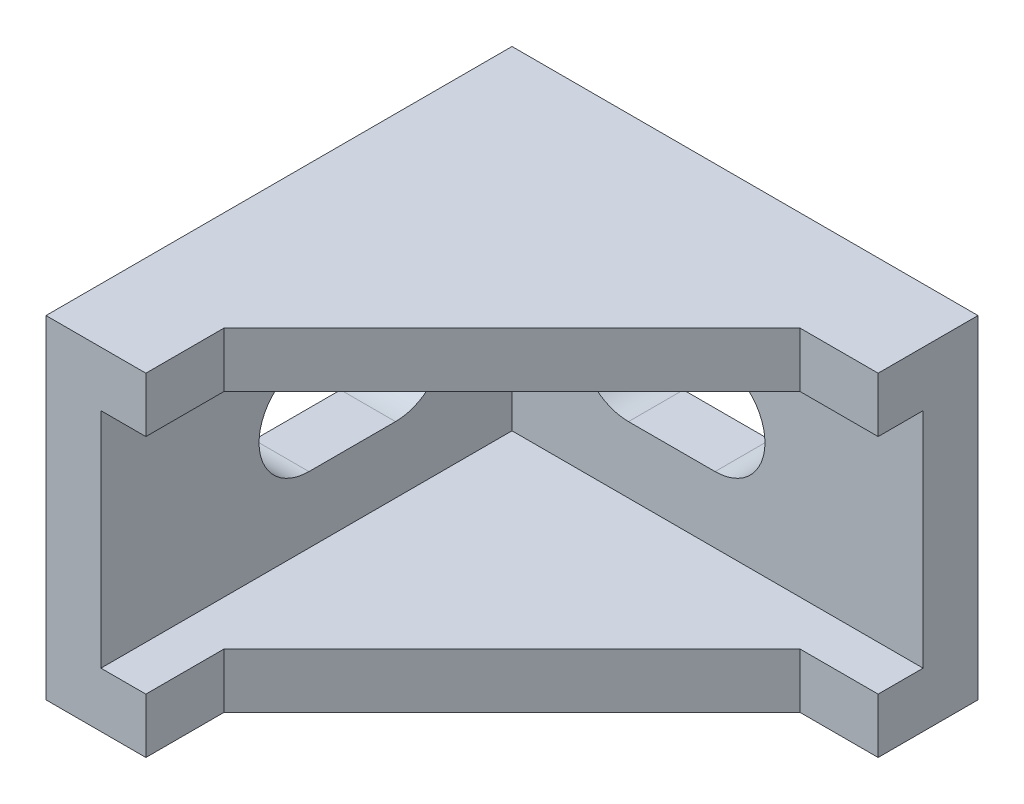
ISO-10303-21;
HEADER;
FILE_DESCRIPTION(('STEP AP214'),'2;1');
FILE_NAME('part.step','',(''),(''),'','','');
FILE_SCHEMA(('AUTOMOTIVE_DESIGN { 1 0 10303 214 1 1 1 1 }'));
ENDSEC;
DATA;
#1=APPLICATION_CONTEXT('core data for automotive mechanical design processes');
#2=APPLICATION_PROTOCOL_DEFINITION('international standard','automotive_design',2000,#1);
#3=PRODUCT_CONTEXT('',#1,'mechanical');
#4=PRODUCT('Part','Part','',(#3));
#5=PRODUCT_RELATED_PRODUCT_CATEGORY('part','',(#4));
#6=PRODUCT_DEFINITION_FORMATION('','',#4);
#7=PRODUCT_DEFINITION_CONTEXT('part definition',#1,'design');
#8=PRODUCT_DEFINITION('design','',#6,#7);
#9=PRODUCT_DEFINITION_SHAPE('','',#8);
#10=(LENGTH_UNIT() NAMED_UNIT(*) SI_UNIT(.MILLI.,.METRE.));
#11=(NAMED_UNIT(*) PLANE_ANGLE_UNIT() SI_UNIT($,.RADIAN.));
#12=(NAMED_UNIT(*) SI_UNIT($,.STERADIAN.) SOLID_ANGLE_UNIT());
#13=UNCERTAINTY_MEASURE_WITH_UNIT(LENGTH_MEASURE(1.E-05),#10,'distance_accuracy_value','');
#14=(GEOMETRIC_REPRESENTATION_CONTEXT(3) GLOBAL_UNCERTAINTY_ASSIGNED_CONTEXT((#13)) GLOBAL_UNIT_ASSIGNED_CONTEXT((#10,
#11,#12)) REPRESENTATION_CONTEXT('',''));
#15=CARTESIAN_POINT('',(0.,0.,0.));
#16=DIRECTION('',(0.,0.,1.));
#17=DIRECTION('',(1.,0.,0.));
#18=AXIS2_PLACEMENT_3D('',#15,#16,#17);
#19=CARTESIAN_POINT('',(28.,20.,-22.0000000000001));
#20=DIRECTION('',(0.,0.,-1.));
#21=DIRECTION('',(-1.,0.,0.));
#22=AXIS2_PLACEMENT_3D('',#19,#20,#21);
#23=PLANE('',#22);
#24=DIRECTION('',(0.,-1.,0.));
#25=VECTOR('',#24,1.);
#26=CARTESIAN_POINT('',(23.3,20.,-22.0000000000001));
#27=LINE('',#26,#25);
#28=CARTESIAN_POINT('',(23.3,20.,-22.0000000000001));
#29=VERTEX_POINT('',#28);
#30=CARTESIAN_POINT('',(23.3,16.7,-22.0000000000001));
#31=VERTEX_POINT('',#30);
#32=EDGE_CURVE('E254',#29,#31,#27,.T.);
#33=ORIENTED_EDGE('',*,*,#32,.T.);
#34=DIRECTION('',(1.,0.,0.));
#35=VECTOR('',#34,1.);
#36=CARTESIAN_POINT('',(28.,16.7,-22.0000000000001));
#37=LINE('',#36,#35);
#38=CARTESIAN_POINT('',(28.,16.7,-22.0000000000001));
#39=VERTEX_POINT('',#38);
#40=EDGE_CURVE('E230',#31,#39,#37,.T.);
#41=ORIENTED_EDGE('',*,*,#40,.T.);
#42=DIRECTION('',(0.,-1.,0.));
#43=VECTOR('',#42,1.);
#44=CARTESIAN_POINT('',(28.,20.,-22.0000000000001));
#45=LINE('',#44,#43);
#46=CARTESIAN_POINT('',(28.,20.,-22.0000000000001));
#47=VERTEX_POINT('',#46);
#48=EDGE_CURVE('E250',#47,#39,#45,.T.);
#49=ORIENTED_EDGE('',*,*,#48,.F.);
#50=DIRECTION('',(1.,0.,0.));
#51=VECTOR('',#50,1.);
#52=CARTESIAN_POINT('',(28.,20.,-22.0000000000001));
#53=LINE('',#52,#51);
#54=EDGE_CURVE('E239',#29,#47,#53,.T.);
#55=ORIENTED_EDGE('',*,*,#54,.F.);
#56=EDGE_LOOP('',(#33,#41,#49,#55));
#57=FACE_BOUND('',#56,.T.);
#58=ADVANCED_FACE('F33',(#57),#23,.F.);
#59=CARTESIAN_POINT('',(23.3,20.,-22.0000000000001));
#60=DIRECTION('',(-0.707106781186549,0.,-0.707106781186546));
#61=DIRECTION('',(-0.707106781186546,0.,0.707106781186549));
#62=AXIS2_PLACEMENT_3D('',#59,#60,#61);
#63=PLANE('',#62);
#64=DIRECTION('',(0.,-1.,0.));
#65=VECTOR('',#64,1.);
#66=CARTESIAN_POINT('',(6.,20.,-4.7));
#67=LINE('',#66,#65);
#68=CARTESIAN_POINT('',(6.,20.,-4.7));
#69=VERTEX_POINT('',#68);
#70=CARTESIAN_POINT('',(6.,16.7,-4.7));
#71=VERTEX_POINT('',#70);
#72=EDGE_CURVE('E258',#69,#71,#67,.T.);
#73=ORIENTED_EDGE('',*,*,#72,.T.);
#74=DIRECTION('',(0.707106781186546,0.,-0.707106781186549));
#75=VECTOR('',#74,1.);
#76=CARTESIAN_POINT('',(23.3,16.7,-22.0000000000001));
#77=LINE('',#76,#75);
#78=EDGE_CURVE('E227',#71,#31,#77,.T.);
#79=ORIENTED_EDGE('',*,*,#78,.T.);
#80=ORIENTED_EDGE('',*,*,#32,.F.);
#81=DIRECTION('',(0.707106781186546,0.,-0.707106781186549));
#82=VECTOR('',#81,1.);
#83=CARTESIAN_POINT('',(23.3,20.,-22.0000000000001));
#84=LINE('',#83,#82);
#85=EDGE_CURVE('E236',#69,#29,#84,.T.);
#86=ORIENTED_EDGE('',*,*,#85,.F.);
#87=EDGE_LOOP('',(#73,#79,#80,#86));
#88=FACE_BOUND('',#87,.T.);
#89=ADVANCED_FACE('F396',(#88),#63,.F.);
#90=CARTESIAN_POINT('',(6.,20.,0.));
#91=DIRECTION('',(-1.,0.,0.));
#92=DIRECTION('',(0.,0.,1.));
#93=AXIS2_PLACEMENT_3D('',#90,#91,#92);
#94=PLANE('',#93);
#95=DIRECTION('',(0.,-1.,0.));
#96=VECTOR('',#95,1.);
#97=CARTESIAN_POINT('',(6.,20.,0.));
#98=LINE('',#97,#96);
#99=CARTESIAN_POINT('',(6.,20.,0.));
#100=VERTEX_POINT('',#99);
#101=CARTESIAN_POINT('',(6.,16.7,0.));
#102=VERTEX_POINT('',#101);
#103=EDGE_CURVE('E262',#100,#102,#98,.T.);
#104=ORIENTED_EDGE('',*,*,#103,.T.);
#105=DIRECTION('',(0.,0.,-1.));
#106=VECTOR('',#105,1.);
#107=CARTESIAN_POINT('',(6.,16.7,0.));
#108=LINE('',#107,#106);
#109=EDGE_CURVE('E11',#102,#71,#108,.T.);
#110=ORIENTED_EDGE('',*,*,#109,.T.);
#111=ORIENTED_EDGE('',*,*,#72,.F.);
#112=DIRECTION('',(0.,0.,-1.));
#113=VECTOR('',#112,1.);
#114=CARTESIAN_POINT('',(6.,20.,0.));
#115=LINE('',#114,#113);
#116=EDGE_CURVE('E234',#100,#69,#115,.T.);
#117=ORIENTED_EDGE('',*,*,#116,.F.);
#118=EDGE_LOOP('',(#104,#110,#111,#117));
#119=FACE_BOUND('',#118,.T.);
#120=ADVANCED_FACE('F390',(#119),#94,.F.);
#121=CARTESIAN_POINT('',(0.,0.,0.));
#122=DIRECTION('',(-1.,0.,0.));
#123=DIRECTION('',(0.,0.,1.));
#124=AXIS2_PLACEMENT_3D('',#121,#122,#123);
#125=PLANE('',#124);
#126=DIRECTION('',(0.,1.,0.));
#127=VECTOR('',#126,1.);
#128=CARTESIAN_POINT('',(0.,0.,-28.));
#129=LINE('',#128,#127);
#130=CARTESIAN_POINT('',(0.,0.,-28.));
#131=VERTEX_POINT('',#130);
#132=CARTESIAN_POINT('',(0.,20.,-28.));
#133=VERTEX_POINT('',#132);
#134=EDGE_CURVE('E337',#131,#133,#129,.T.);
#135=ORIENTED_EDGE('',*,*,#134,.F.);
#136=DIRECTION('',(0.,0.,-1.));
#137=VECTOR('',#136,1.);
#138=CARTESIAN_POINT('',(0.,0.,0.));
#139=LINE('',#138,#137);
#140=CARTESIAN_POINT('',(0.,0.,0.));
#141=VERTEX_POINT('',#140);
#142=EDGE_CURVE('E335',#141,#131,#139,.T.);
#143=ORIENTED_EDGE('',*,*,#142,.F.);
#144=DIRECTION('',(0.,-1.,0.));
#145=VECTOR('',#144,1.);
#146=CARTESIAN_POINT('',(0.,0.,0.));
#147=LINE('',#146,#145);
#148=CARTESIAN_POINT('',(0.,20.,0.));
#149=VERTEX_POINT('',#148);
#150=EDGE_CURVE('E332',#149,#141,#147,.T.);
#151=ORIENTED_EDGE('',*,*,#150,.F.);
#152=DIRECTION('',(0.,0.,1.));
#153=VECTOR('',#152,1.);
#154=CARTESIAN_POINT('',(0.,20.,0.));
#155=LINE('',#154,#153);
#156=EDGE_CURVE('E339',#133,#149,#155,.T.);
#157=ORIENTED_EDGE('',*,*,#156,.F.);
#158=EDGE_LOOP('',(#135,#143,#151,#157));
#159=FACE_BOUND('',#158,.T.);
#160=DIRECTION('',(0.,0.,1.));
#161=VECTOR('',#160,1.);
#162=CARTESIAN_POINT('',(0.,13.28,-12.5));
#163=LINE('',#162,#161);
#164=CARTESIAN_POINT('',(0.,13.28,-17.7));
#165=VERTEX_POINT('',#164);
#166=CARTESIAN_POINT('',(0.,13.28,-12.5));
#167=VERTEX_POINT('',#166);
#168=EDGE_CURVE('E306',#165,#167,#163,.T.);
#169=ORIENTED_EDGE('',*,*,#168,.T.);
#170=CARTESIAN_POINT('',(0.,10.28,-12.5));
#171=DIRECTION('',(1.,0.,0.));
#172=DIRECTION('',(0.,0.,-1.));
#173=AXIS2_PLACEMENT_3D('',#170,#171,#172);
#174=CIRCLE('',#173,3.);
#175=CARTESIAN_POINT('',(0.,7.28,-12.5));
#176=VERTEX_POINT('',#175);
#177=EDGE_CURVE('E56',#167,#176,#174,.T.);
#178=ORIENTED_EDGE('',*,*,#177,.T.);
#179=DIRECTION('',(0.,0.,-1.));
#180=VECTOR('',#179,1.);
#181=CARTESIAN_POINT('',(0.,7.28,-12.5));
#182=LINE('',#181,#180);
#183=CARTESIAN_POINT('',(0.,7.28,-17.7));
#184=VERTEX_POINT('',#183);
#185=EDGE_CURVE('E317',#176,#184,#182,.T.);
#186=ORIENTED_EDGE('',*,*,#185,.T.);
#187=CARTESIAN_POINT('',(0.,10.28,-17.7));
#188=DIRECTION('',(1.,0.,0.));
#189=DIRECTION('',(0.,0.,-1.));
#190=AXIS2_PLACEMENT_3D('',#187,#188,#189);
#191=CIRCLE('',#190,3.);
#192=EDGE_CURVE('E320',#184,#165,#191,.T.);
#193=ORIENTED_EDGE('',*,*,#192,.T.);
#194=EDGE_LOOP('',(#169,#178,#186,#193));
#195=FACE_BOUND('',#194,.T.);
#196=ADVANCED_FACE('F381',(#159,#195),#125,.T.);
#197=CARTESIAN_POINT('',(3.3,0.,0.));
#198=DIRECTION('',(0.,0.,-1.));
#199=DIRECTION('',(-1.,0.,0.));
#200=AXIS2_PLACEMENT_3D('',#197,#198,#199);
#201=PLANE('',#200);
#202=DIRECTION('',(0.,-1.,0.));
#203=VECTOR('',#202,1.);
#204=CARTESIAN_POINT('',(3.3,16.7,0.));
#205=LINE('',#204,#203);
#206=CARTESIAN_POINT('',(3.3,16.7,0.));
#207=VERTEX_POINT('',#206);
#208=CARTESIAN_POINT('',(3.3,3.3,0.));
#209=VERTEX_POINT('',#208);
#210=EDGE_CURVE('E193',#207,#209,#205,.T.);
#211=ORIENTED_EDGE('',*,*,#210,.F.);
#212=DIRECTION('',(-1.,0.,0.));
#213=VECTOR('',#212,1.);
#214=CARTESIAN_POINT('',(3.3,16.7,0.));
#215=LINE('',#214,#213);
#216=EDGE_CURVE('E208',#102,#207,#215,.T.);
#217=ORIENTED_EDGE('',*,*,#216,.F.);
#218=ORIENTED_EDGE('',*,*,#103,.F.);
#219=DIRECTION('',(-1.,0.,0.));
#220=VECTOR('',#219,1.);
#221=CARTESIAN_POINT('',(3.3,20.,0.));
#222=LINE('',#221,#220);
#223=EDGE_CURVE('E341',#100,#149,#222,.T.);
#224=ORIENTED_EDGE('',*,*,#223,.T.);
#225=ORIENTED_EDGE('',*,*,#150,.T.);
#226=DIRECTION('',(-1.,0.,0.));
#227=VECTOR('',#226,1.);
#228=CARTESIAN_POINT('',(3.3,0.,0.));
#229=LINE('',#228,#227);
#230=CARTESIAN_POINT('',(6.,0.,0.));
#231=VERTEX_POINT('',#230);
#232=EDGE_CURVE('E350',#231,#141,#229,.T.);
#233=ORIENTED_EDGE('',*,*,#232,.F.);
#234=CARTESIAN_POINT('',(6.,3.3,0.));
#235=VERTEX_POINT('',#234);
#236=EDGE_CURVE('E261',#235,#231,#98,.T.);
#237=ORIENTED_EDGE('',*,*,#236,.F.);
#238=DIRECTION('',(1.,0.,0.));
#239=VECTOR('',#238,1.);
#240=CARTESIAN_POINT('',(3.3,3.3,0.));
#241=LINE('',#240,#239);
#242=EDGE_CURVE('E48',#209,#235,#241,.T.);
#243=ORIENTED_EDGE('',*,*,#242,.F.);
#244=EDGE_LOOP('',(#211,#217,#218,#224,#225,#233,#237,#243));
#245=FACE_BOUND('',#244,.T.);
#246=ADVANCED_FACE('F35',(#245),#201,.F.);
#247=CARTESIAN_POINT('',(3.3,0.,0.));
#248=DIRECTION('',(0.,1.,0.));
#249=DIRECTION('',(0.,0.,1.));
#250=AXIS2_PLACEMENT_3D('',#247,#248,#249);
#251=PLANE('',#250);
#252=DIRECTION('',(-1.,0.,0.));
#253=VECTOR('',#252,1.);
#254=CARTESIAN_POINT('',(3.3,0.,-28.));
#255=LINE('',#254,#253);
#256=CARTESIAN_POINT('',(28.,0.,-28.0000000000001));
#257=VERTEX_POINT('',#256);
#258=EDGE_CURVE('E347',#257,#131,#255,.T.);
#259=ORIENTED_EDGE('',*,*,#258,.F.);
#260=DIRECTION('',(0.,0.,-1.));
#261=VECTOR('',#260,1.);
#262=CARTESIAN_POINT('',(28.,0.,-24.7000000000001));
#263=LINE('',#262,#261);
#264=CARTESIAN_POINT('',(28.,0.,-22.0000000000001));
#265=VERTEX_POINT('',#264);
#266=EDGE_CURVE('E296',#265,#257,#263,.T.);
#267=ORIENTED_EDGE('',*,*,#266,.F.);
#268=DIRECTION('',(1.,0.,0.));
#269=VECTOR('',#268,1.);
#270=CARTESIAN_POINT('',(28.,0.,-22.0000000000001));
#271=LINE('',#270,#269);
#272=CARTESIAN_POINT('',(23.3,0.,-22.0000000000001));
#273=VERTEX_POINT('',#272);
#274=EDGE_CURVE('E237',#273,#265,#271,.T.);
#275=ORIENTED_EDGE('',*,*,#274,.F.);
#276=DIRECTION('',(0.707106781186546,0.,-0.707106781186549));
#277=VECTOR('',#276,1.);
#278=CARTESIAN_POINT('',(23.3,0.,-22.0000000000001));
#279=LINE('',#278,#277);
#280=CARTESIAN_POINT('',(6.,0.,-4.7));
#281=VERTEX_POINT('',#280);
#282=EDGE_CURVE('E245',#281,#273,#279,.T.);
#283=ORIENTED_EDGE('',*,*,#282,.F.);
#284=DIRECTION('',(0.,0.,-1.));
#285=VECTOR('',#284,1.);
#286=CARTESIAN_POINT('',(6.,0.,0.));
#287=LINE('',#286,#285);
#288=EDGE_CURVE('E233',#231,#281,#287,.T.);
#289=ORIENTED_EDGE('',*,*,#288,.F.);
#290=ORIENTED_EDGE('',*,*,#232,.T.);
#291=ORIENTED_EDGE('',*,*,#142,.T.);
#292=EDGE_LOOP('',(#259,#267,#275,#283,#289,#290,#291));
#293=FACE_BOUND('',#292,.T.);
#294=ADVANCED_FACE('F362',(#293),#251,.F.);
#295=CARTESIAN_POINT('',(3.3,0.,-28.));
#296=DIRECTION('',(0.,0.,1.));
#297=DIRECTION('',(1.,0.,0.));
#298=AXIS2_PLACEMENT_3D('',#295,#296,#297);
#299=PLANE('',#298);
#300=ORIENTED_EDGE('',*,*,#134,.T.);
#301=DIRECTION('',(-1.,0.,0.));
#302=VECTOR('',#301,1.);
#303=CARTESIAN_POINT('',(3.3,20.,-28.));
#304=LINE('',#303,#302);
#305=CARTESIAN_POINT('',(28.,20.,-28.0000000000001));
#306=VERTEX_POINT('',#305);
#307=EDGE_CURVE('E344',#306,#133,#304,.T.);
#308=ORIENTED_EDGE('',*,*,#307,.F.);
#309=DIRECTION('',(0.,-1.,0.));
#310=VECTOR('',#309,1.);
#311=CARTESIAN_POINT('',(28.,0.,-28.0000000000001));
#312=LINE('',#311,#310);
#313=EDGE_CURVE('E293',#306,#257,#312,.T.);
#314=ORIENTED_EDGE('',*,*,#313,.T.);
#315=ORIENTED_EDGE('',*,*,#258,.T.);
#316=EDGE_LOOP('',(#300,#308,#314,#315));
#317=FACE_BOUND('',#316,.T.);
#318=CARTESIAN_POINT('',(15.5,10.28,-28.0000000000001));
#319=DIRECTION('',(0.,0.,-1.));
#320=DIRECTION('',(-1.,0.,0.));
#321=AXIS2_PLACEMENT_3D('',#318,#319,#320);
#322=CIRCLE('',#321,3.);
#323=CARTESIAN_POINT('',(15.5,13.28,-28.0000000000001));
#324=VERTEX_POINT('',#323);
#325=CARTESIAN_POINT('',(15.5,7.28,-28.0000000000001));
#326=VERTEX_POINT('',#325);
#327=EDGE_CURVE('E265',#324,#326,#322,.T.);
#328=ORIENTED_EDGE('',*,*,#327,.F.);
#329=DIRECTION('',(1.,0.,0.));
#330=VECTOR('',#329,1.);
#331=CARTESIAN_POINT('',(15.5,13.28,-28.0000000000001));
#332=LINE('',#331,#330);
#333=CARTESIAN_POINT('',(10.3,13.28,-28.));
#334=VERTEX_POINT('',#333);
#335=EDGE_CURVE('E277',#334,#324,#332,.T.);
#336=ORIENTED_EDGE('',*,*,#335,.F.);
#337=CARTESIAN_POINT('',(10.3,10.28,-28.));
#338=DIRECTION('',(0.,0.,-1.));
#339=DIRECTION('',(-1.,0.,0.));
#340=AXIS2_PLACEMENT_3D('',#337,#338,#339);
#341=CIRCLE('',#340,3.);
#342=CARTESIAN_POINT('',(10.3,7.28,-28.));
#343=VERTEX_POINT('',#342);
#344=EDGE_CURVE('E280',#343,#334,#341,.T.);
#345=ORIENTED_EDGE('',*,*,#344,.F.);
#346=DIRECTION('',(-1.,0.,0.));
#347=VECTOR('',#346,1.);
#348=CARTESIAN_POINT('',(15.5,7.28,-28.0000000000001));
#349=LINE('',#348,#347);
#350=EDGE_CURVE('E269',#326,#343,#349,.T.);
#351=ORIENTED_EDGE('',*,*,#350,.F.);
#352=EDGE_LOOP('',(#328,#336,#345,#351));
#353=FACE_BOUND('',#352,.T.);
#354=ADVANCED_FACE('F377',(#317,#353),#299,.F.);
#355=CARTESIAN_POINT('',(3.3,20.,0.));
#356=DIRECTION('',(0.,-1.,0.));
#357=DIRECTION('',(0.,0.,-1.));
#358=AXIS2_PLACEMENT_3D('',#355,#356,#357);
#359=PLANE('',#358);
#360=ORIENTED_EDGE('',*,*,#223,.F.);
#361=ORIENTED_EDGE('',*,*,#116,.T.);
#362=ORIENTED_EDGE('',*,*,#85,.T.);
#363=ORIENTED_EDGE('',*,*,#54,.T.);
#364=DIRECTION('',(0.,0.,-1.));
#365=VECTOR('',#364,1.);
#366=CARTESIAN_POINT('',(28.,20.,-24.7000000000001));
#367=LINE('',#366,#365);
#368=EDGE_CURVE('E299',#47,#306,#367,.T.);
#369=ORIENTED_EDGE('',*,*,#368,.T.);
#370=ORIENTED_EDGE('',*,*,#307,.T.);
#371=ORIENTED_EDGE('',*,*,#156,.T.);
#372=EDGE_LOOP('',(#360,#361,#362,#363,#369,#370,#371));
#373=FACE_BOUND('',#372,.T.);
#374=ADVANCED_FACE('F384',(#373),#359,.F.);
#375=CARTESIAN_POINT('',(3.3,10.28,-12.5));
#376=DIRECTION('',(-1.,0.,0.));
#377=DIRECTION('',(0.,0.,1.));
#378=AXIS2_PLACEMENT_3D('',#375,#376,#377);
#379=CYLINDRICAL_SURFACE('',#378,3.);
#380=ORIENTED_EDGE('',*,*,#177,.F.);
#381=DIRECTION('',(-1.,0.,0.));
#382=VECTOR('',#381,1.);
#383=CARTESIAN_POINT('',(3.3,13.28,-12.5));
#384=LINE('',#383,#382);
#385=CARTESIAN_POINT('',(3.3,13.28,-12.5));
#386=VERTEX_POINT('',#385);
#387=EDGE_CURVE('E315',#386,#167,#384,.T.);
#388=ORIENTED_EDGE('',*,*,#387,.F.);
#389=CARTESIAN_POINT('',(3.3,10.28,-12.5));
#390=DIRECTION('',(1.,0.,0.));
#391=DIRECTION('',(0.,0.,-1.));
#392=AXIS2_PLACEMENT_3D('',#389,#390,#391);
#393=CIRCLE('',#392,3.);
#394=CARTESIAN_POINT('',(3.3,7.28,-12.5));
#395=VERTEX_POINT('',#394);
#396=EDGE_CURVE('E302',#386,#395,#393,.T.);
#397=ORIENTED_EDGE('',*,*,#396,.T.);
#398=DIRECTION('',(-1.,0.,0.));
#399=VECTOR('',#398,1.);
#400=CARTESIAN_POINT('',(3.3,7.28,-12.5));
#401=LINE('',#400,#399);
#402=EDGE_CURVE('E330',#395,#176,#401,.T.);
#403=ORIENTED_EDGE('',*,*,#402,.T.);
#404=EDGE_LOOP('',(#380,#388,#397,#403));
#405=FACE_BOUND('',#404,.T.);
#406=ADVANCED_FACE('F452',(#405),#379,.F.);
#407=CARTESIAN_POINT('',(3.3,7.28,-12.5));
#408=DIRECTION('',(0.,1.,0.));
#409=DIRECTION('',(0.,0.,1.));
#410=AXIS2_PLACEMENT_3D('',#407,#408,#409);
#411=PLANE('',#410);
#412=ORIENTED_EDGE('',*,*,#185,.F.);
#413=ORIENTED_EDGE('',*,*,#402,.F.);
#414=DIRECTION('',(0.,0.,-1.));
#415=VECTOR('',#414,1.);
#416=CARTESIAN_POINT('',(3.3,7.28,-12.5));
#417=LINE('',#416,#415);
#418=CARTESIAN_POINT('',(3.3,7.28,-17.7));
#419=VERTEX_POINT('',#418);
#420=EDGE_CURVE('E305',#395,#419,#417,.T.);
#421=ORIENTED_EDGE('',*,*,#420,.T.);
#422=DIRECTION('',(-1.,0.,0.));
#423=VECTOR('',#422,1.);
#424=CARTESIAN_POINT('',(3.3,7.28,-17.7));
#425=LINE('',#424,#423);
#426=EDGE_CURVE('E328',#419,#184,#425,.T.);
#427=ORIENTED_EDGE('',*,*,#426,.T.);
#428=EDGE_LOOP('',(#412,#413,#421,#427));
#429=FACE_BOUND('',#428,.T.);
#430=ADVANCED_FACE('F448',(#429),#411,.T.);
#431=CARTESIAN_POINT('',(3.3,10.28,-17.7));
#432=DIRECTION('',(-1.,0.,0.));
#433=DIRECTION('',(0.,0.,1.));
#434=AXIS2_PLACEMENT_3D('',#431,#432,#433);
#435=CYLINDRICAL_SURFACE('',#434,3.);
#436=ORIENTED_EDGE('',*,*,#192,.F.);
#437=ORIENTED_EDGE('',*,*,#426,.F.);
#438=CARTESIAN_POINT('',(3.3,10.28,-17.7));
#439=DIRECTION('',(1.,0.,0.));
#440=DIRECTION('',(0.,0.,-1.));
#441=AXIS2_PLACEMENT_3D('',#438,#439,#440);
#442=CIRCLE('',#441,3.);
#443=CARTESIAN_POINT('',(3.3,13.28,-17.7));
#444=VERTEX_POINT('',#443);
#445=EDGE_CURVE('E309',#419,#444,#442,.T.);
#446=ORIENTED_EDGE('',*,*,#445,.T.);
#447=DIRECTION('',(-1.,0.,0.));
#448=VECTOR('',#447,1.);
#449=CARTESIAN_POINT('',(3.3,13.28,-17.7));
#450=LINE('',#449,#448);
#451=EDGE_CURVE('E326',#444,#165,#450,.T.);
#452=ORIENTED_EDGE('',*,*,#451,.T.);
#453=EDGE_LOOP('',(#436,#437,#446,#452));
#454=FACE_BOUND('',#453,.T.);
#455=ADVANCED_FACE('F444',(#454),#435,.F.);
#456=CARTESIAN_POINT('',(3.3,13.28,-12.5));
#457=DIRECTION('',(0.,-1.,0.));
#458=DIRECTION('',(0.,0.,-1.));
#459=AXIS2_PLACEMENT_3D('',#456,#457,#458);
#460=PLANE('',#459);
#461=ORIENTED_EDGE('',*,*,#168,.F.);
#462=ORIENTED_EDGE('',*,*,#451,.F.);
#463=DIRECTION('',(0.,0.,1.));
#464=VECTOR('',#463,1.);
#465=CARTESIAN_POINT('',(3.3,13.28,-12.5));
#466=LINE('',#465,#464);
#467=EDGE_CURVE('E312',#444,#386,#466,.T.);
#468=ORIENTED_EDGE('',*,*,#467,.T.);
#469=ORIENTED_EDGE('',*,*,#387,.T.);
#470=EDGE_LOOP('',(#461,#462,#468,#469));
#471=FACE_BOUND('',#470,.T.);
#472=ADVANCED_FACE('F441',(#471),#460,.T.);
#473=CARTESIAN_POINT('',(28.,0.,-24.7000000000001));
#474=DIRECTION('',(1.,0.,0.));
#475=DIRECTION('',(0.,0.,-1.));
#476=AXIS2_PLACEMENT_3D('',#473,#474,#475);
#477=PLANE('',#476);
#478=DIRECTION('',(0.,0.,1.));
#479=VECTOR('',#478,1.);
#480=CARTESIAN_POINT('',(28.,16.7,-24.7));
#481=LINE('',#480,#479);
#482=CARTESIAN_POINT('',(28.,16.7,-24.7));
#483=VERTEX_POINT('',#482);
#484=EDGE_CURVE('E219',#483,#39,#481,.T.);
#485=ORIENTED_EDGE('',*,*,#484,.F.);
#486=DIRECTION('',(0.,1.,0.));
#487=VECTOR('',#486,1.);
#488=CARTESIAN_POINT('',(28.,16.7,-24.7));
#489=LINE('',#488,#487);
#490=CARTESIAN_POINT('',(28.,3.3,-24.7));
#491=VERTEX_POINT('',#490);
#492=EDGE_CURVE('E203',#491,#483,#489,.T.);
#493=ORIENTED_EDGE('',*,*,#492,.F.);
#494=DIRECTION('',(0.,0.,1.));
#495=VECTOR('',#494,1.);
#496=CARTESIAN_POINT('',(28.,3.3,-24.7));
#497=LINE('',#496,#495);
#498=CARTESIAN_POINT('',(28.,3.3,-22.0000000000001));
#499=VERTEX_POINT('',#498);
#500=EDGE_CURVE('E194',#491,#499,#497,.T.);
#501=ORIENTED_EDGE('',*,*,#500,.T.);
#502=EDGE_CURVE('E242',#499,#265,#45,.T.);
#503=ORIENTED_EDGE('',*,*,#502,.T.);
#504=ORIENTED_EDGE('',*,*,#266,.T.);
#505=ORIENTED_EDGE('',*,*,#313,.F.);
#506=ORIENTED_EDGE('',*,*,#368,.F.);
#507=ORIENTED_EDGE('',*,*,#48,.T.);
#508=EDGE_LOOP('',(#485,#493,#501,#503,#504,#505,#506,#507));
#509=FACE_BOUND('',#508,.T.);
#510=ADVANCED_FACE('F373',(#509),#477,.T.);
#511=CARTESIAN_POINT('',(15.5,10.28,-24.7000000000001));
#512=DIRECTION('',(0.,0.,-1.));
#513=DIRECTION('',(-1.,0.,0.));
#514=AXIS2_PLACEMENT_3D('',#511,#512,#513);
#515=CYLINDRICAL_SURFACE('',#514,3.);
#516=ORIENTED_EDGE('',*,*,#327,.T.);
#517=DIRECTION('',(0.,0.,-1.));
#518=VECTOR('',#517,1.);
#519=CARTESIAN_POINT('',(15.5,7.28,-24.7000000000001));
#520=LINE('',#519,#518);
#521=CARTESIAN_POINT('',(15.5,7.28,-24.7000000000001));
#522=VERTEX_POINT('',#521);
#523=EDGE_CURVE('E275',#522,#326,#520,.T.);
#524=ORIENTED_EDGE('',*,*,#523,.F.);
#525=CARTESIAN_POINT('',(15.5,10.28,-24.7000000000001));
#526=DIRECTION('',(0.,0.,-1.));
#527=DIRECTION('',(-1.,0.,0.));
#528=AXIS2_PLACEMENT_3D('',#525,#526,#527);
#529=CIRCLE('',#528,3.);
#530=CARTESIAN_POINT('',(15.5,13.28,-24.7000000000001));
#531=VERTEX_POINT('',#530);
#532=EDGE_CURVE('E266',#531,#522,#529,.T.);
#533=ORIENTED_EDGE('',*,*,#532,.F.);
#534=DIRECTION('',(0.,0.,-1.));
#535=VECTOR('',#534,1.);
#536=CARTESIAN_POINT('',(15.5,13.28,-24.7000000000001));
#537=LINE('',#536,#535);
#538=EDGE_CURVE('E291',#531,#324,#537,.T.);
#539=ORIENTED_EDGE('',*,*,#538,.T.);
#540=EDGE_LOOP('',(#516,#524,#533,#539));
#541=FACE_BOUND('',#540,.T.);
#542=ADVANCED_FACE('F434',(#541),#515,.F.);
#543=CARTESIAN_POINT('',(15.5,13.28,-24.7000000000001));
#544=DIRECTION('',(0.,1.,0.));
#545=DIRECTION('',(0.,0.,1.));
#546=AXIS2_PLACEMENT_3D('',#543,#544,#545);
#547=PLANE('',#546);
#548=ORIENTED_EDGE('',*,*,#335,.T.);
#549=ORIENTED_EDGE('',*,*,#538,.F.);
#550=DIRECTION('',(1.,0.,0.));
#551=VECTOR('',#550,1.);
#552=CARTESIAN_POINT('',(15.5,13.28,-24.7000000000001));
#553=LINE('',#552,#551);
#554=CARTESIAN_POINT('',(10.3,13.28,-24.7));
#555=VERTEX_POINT('',#554);
#556=EDGE_CURVE('E268',#555,#531,#553,.T.);
#557=ORIENTED_EDGE('',*,*,#556,.F.);
#558=DIRECTION('',(0.,0.,-1.));
#559=VECTOR('',#558,1.);
#560=CARTESIAN_POINT('',(10.3,13.28,-24.7));
#561=LINE('',#560,#559);
#562=EDGE_CURVE('E289',#555,#334,#561,.T.);
#563=ORIENTED_EDGE('',*,*,#562,.T.);
#564=EDGE_LOOP('',(#548,#549,#557,#563));
#565=FACE_BOUND('',#564,.T.);
#566=ADVANCED_FACE('F427',(#565),#547,.F.);
#567=CARTESIAN_POINT('',(10.3,10.28,-24.7));
#568=DIRECTION('',(0.,0.,-1.));
#569=DIRECTION('',(-1.,0.,0.));
#570=AXIS2_PLACEMENT_3D('',#567,#568,#569);
#571=CYLINDRICAL_SURFACE('',#570,3.);
#572=ORIENTED_EDGE('',*,*,#344,.T.);
#573=ORIENTED_EDGE('',*,*,#562,.F.);
#574=CARTESIAN_POINT('',(10.3,10.28,-24.7));
#575=DIRECTION('',(0.,0.,-1.));
#576=DIRECTION('',(-1.,0.,0.));
#577=AXIS2_PLACEMENT_3D('',#574,#575,#576);
#578=CIRCLE('',#577,3.);
#579=CARTESIAN_POINT('',(10.3,7.28,-24.7));
#580=VERTEX_POINT('',#579);
#581=EDGE_CURVE('E271',#580,#555,#578,.T.);
#582=ORIENTED_EDGE('',*,*,#581,.F.);
#583=DIRECTION('',(0.,0.,-1.));
#584=VECTOR('',#583,1.);
#585=CARTESIAN_POINT('',(10.3,7.28,-24.7));
#586=LINE('',#585,#584);
#587=EDGE_CURVE('E287',#580,#343,#586,.T.);
#588=ORIENTED_EDGE('',*,*,#587,.T.);
#589=EDGE_LOOP('',(#572,#573,#582,#588));
#590=FACE_BOUND('',#589,.T.);
#591=ADVANCED_FACE('F421',(#590),#571,.F.);
#592=CARTESIAN_POINT('',(15.5,7.28,-24.7000000000001));
#593=DIRECTION('',(0.,-1.,0.));
#594=DIRECTION('',(0.,0.,-1.));
#595=AXIS2_PLACEMENT_3D('',#592,#593,#594);
#596=PLANE('',#595);
#597=ORIENTED_EDGE('',*,*,#350,.T.);
#598=ORIENTED_EDGE('',*,*,#587,.F.);
#599=DIRECTION('',(-1.,0.,0.));
#600=VECTOR('',#599,1.);
#601=CARTESIAN_POINT('',(15.5,7.28,-24.7000000000001));
#602=LINE('',#601,#600);
#603=EDGE_CURVE('E273',#522,#580,#602,.T.);
#604=ORIENTED_EDGE('',*,*,#603,.F.);
#605=ORIENTED_EDGE('',*,*,#523,.T.);
#606=EDGE_LOOP('',(#597,#598,#604,#605));
#607=FACE_BOUND('',#606,.T.);
#608=ADVANCED_FACE('F416',(#607),#596,.F.);
#609=ORIENTED_EDGE('',*,*,#502,.F.);
#610=DIRECTION('',(-1.,0.,0.));
#611=VECTOR('',#610,1.);
#612=CARTESIAN_POINT('',(28.,3.3,-22.0000000000001));
#613=LINE('',#612,#611);
#614=CARTESIAN_POINT('',(23.3,3.3,-22.0000000000001));
#615=VERTEX_POINT('',#614);
#616=EDGE_CURVE('E224',#499,#615,#613,.T.);
#617=ORIENTED_EDGE('',*,*,#616,.T.);
#618=EDGE_CURVE('E253',#615,#273,#27,.T.);
#619=ORIENTED_EDGE('',*,*,#618,.T.);
#620=ORIENTED_EDGE('',*,*,#274,.T.);
#621=EDGE_LOOP('',(#609,#617,#619,#620));
#622=FACE_BOUND('',#621,.T.);
#623=ADVANCED_FACE('F370',(#622),#23,.F.);
#624=ORIENTED_EDGE('',*,*,#618,.F.);
#625=DIRECTION('',(-0.707106781186546,0.,0.707106781186549));
#626=VECTOR('',#625,1.);
#627=CARTESIAN_POINT('',(23.3,3.3,-22.0000000000001));
#628=LINE('',#627,#626);
#629=CARTESIAN_POINT('',(6.,3.3,-4.7));
#630=VERTEX_POINT('',#629);
#631=EDGE_CURVE('E218',#615,#630,#628,.T.);
#632=ORIENTED_EDGE('',*,*,#631,.T.);
#633=EDGE_CURVE('E257',#630,#281,#67,.T.);
#634=ORIENTED_EDGE('',*,*,#633,.T.);
#635=ORIENTED_EDGE('',*,*,#282,.T.);
#636=EDGE_LOOP('',(#624,#632,#634,#635));
#637=FACE_BOUND('',#636,.T.);
#638=ADVANCED_FACE('F367',(#637),#63,.F.);
#639=ORIENTED_EDGE('',*,*,#633,.F.);
#640=DIRECTION('',(0.,0.,1.));
#641=VECTOR('',#640,1.);
#642=CARTESIAN_POINT('',(6.,3.3,0.));
#643=LINE('',#642,#641);
#644=EDGE_CURVE('E41',#630,#235,#643,.T.);
#645=ORIENTED_EDGE('',*,*,#644,.T.);
#646=ORIENTED_EDGE('',*,*,#236,.T.);
#647=ORIENTED_EDGE('',*,*,#288,.T.);
#648=EDGE_LOOP('',(#639,#645,#646,#647));
#649=FACE_BOUND('',#648,.T.);
#650=ADVANCED_FACE('F355',(#649),#94,.F.);
#651=CARTESIAN_POINT('',(3.3,16.7,-24.7));
#652=DIRECTION('',(-1.,0.,0.));
#653=DIRECTION('',(0.,-1.,0.));
#654=AXIS2_PLACEMENT_3D('',#651,#652,#653);
#655=PLANE('',#654);
#656=ORIENTED_EDGE('',*,*,#210,.T.);
#657=DIRECTION('',(0.,0.,1.));
#658=VECTOR('',#657,1.);
#659=CARTESIAN_POINT('',(3.3,3.3,-24.7));
#660=LINE('',#659,#658);
#661=CARTESIAN_POINT('',(3.3,3.3,-24.7));
#662=VERTEX_POINT('',#661);
#663=EDGE_CURVE('E184',#662,#209,#660,.T.);
#664=ORIENTED_EDGE('',*,*,#663,.F.);
#665=DIRECTION('',(0.,-1.,0.));
#666=VECTOR('',#665,1.);
#667=CARTESIAN_POINT('',(3.3,16.7,-24.7));
#668=LINE('',#667,#666);
#669=CARTESIAN_POINT('',(3.3,16.7,-24.7));
#670=VERTEX_POINT('',#669);
#671=EDGE_CURVE('E190',#670,#662,#668,.T.);
#672=ORIENTED_EDGE('',*,*,#671,.F.);
#673=DIRECTION('',(0.,0.,1.));
#674=VECTOR('',#673,1.);
#675=CARTESIAN_POINT('',(3.3,16.7,-24.7));
#676=LINE('',#675,#674);
#677=EDGE_CURVE('E216',#670,#207,#676,.T.);
#678=ORIENTED_EDGE('',*,*,#677,.T.);
#679=EDGE_LOOP('',(#656,#664,#672,#678));
#680=FACE_BOUND('',#679,.T.);
#681=ORIENTED_EDGE('',*,*,#467,.F.);
#682=ORIENTED_EDGE('',*,*,#445,.F.);
#683=ORIENTED_EDGE('',*,*,#420,.F.);
#684=ORIENTED_EDGE('',*,*,#396,.F.);
#685=EDGE_LOOP('',(#681,#682,#683,#684));
#686=FACE_BOUND('',#685,.T.);
#687=ADVANCED_FACE('F186',(#680,#686),#655,.F.);
#688=CARTESIAN_POINT('',(0.,0.,-24.7));
#689=DIRECTION('',(0.,0.,1.));
#690=DIRECTION('',(1.,0.,0.));
#691=AXIS2_PLACEMENT_3D('',#688,#689,#690);
#692=PLANE('',#691);
#693=ORIENTED_EDGE('',*,*,#671,.T.);
#694=DIRECTION('',(1.,0.,0.));
#695=VECTOR('',#694,1.);
#696=CARTESIAN_POINT('',(3.3,3.3,-24.7));
#697=LINE('',#696,#695);
#698=EDGE_CURVE('E198',#662,#491,#697,.T.);
#699=ORIENTED_EDGE('',*,*,#698,.T.);
#700=ORIENTED_EDGE('',*,*,#492,.T.);
#701=DIRECTION('',(-1.,0.,0.));
#702=VECTOR('',#701,1.);
#703=CARTESIAN_POINT('',(3.3,16.7,-24.7));
#704=LINE('',#703,#702);
#705=EDGE_CURVE('E195',#483,#670,#704,.T.);
#706=ORIENTED_EDGE('',*,*,#705,.T.);
#707=EDGE_LOOP('',(#693,#699,#700,#706));
#708=FACE_BOUND('',#707,.T.);
#709=ORIENTED_EDGE('',*,*,#556,.T.);
#710=ORIENTED_EDGE('',*,*,#532,.T.);
#711=ORIENTED_EDGE('',*,*,#603,.T.);
#712=ORIENTED_EDGE('',*,*,#581,.T.);
#713=EDGE_LOOP('',(#709,#710,#711,#712));
#714=FACE_BOUND('',#713,.T.);
#715=ADVANCED_FACE('F205',(#708,#714),#692,.T.);
#716=CARTESIAN_POINT('',(3.3,16.7,-24.7));
#717=DIRECTION('',(0.,1.,0.));
#718=DIRECTION('',(0.,0.,1.));
#719=AXIS2_PLACEMENT_3D('',#716,#717,#718);
#720=PLANE('',#719);
#721=ORIENTED_EDGE('',*,*,#78,.F.);
#722=ORIENTED_EDGE('',*,*,#109,.F.);
#723=ORIENTED_EDGE('',*,*,#216,.T.);
#724=ORIENTED_EDGE('',*,*,#677,.F.);
#725=ORIENTED_EDGE('',*,*,#705,.F.);
#726=ORIENTED_EDGE('',*,*,#484,.T.);
#727=ORIENTED_EDGE('',*,*,#40,.F.);
#728=EDGE_LOOP('',(#721,#722,#723,#724,#725,#726,#727));
#729=FACE_BOUND('',#728,.T.);
#730=ADVANCED_FACE('F399',(#729),#720,.F.);
#731=CARTESIAN_POINT('',(3.3,3.3,-24.7));
#732=DIRECTION('',(0.,-1.,0.));
#733=DIRECTION('',(0.,0.,-1.));
#734=AXIS2_PLACEMENT_3D('',#731,#732,#733);
#735=PLANE('',#734);
#736=ORIENTED_EDGE('',*,*,#500,.F.);
#737=ORIENTED_EDGE('',*,*,#698,.F.);
#738=ORIENTED_EDGE('',*,*,#663,.T.);
#739=ORIENTED_EDGE('',*,*,#242,.T.);
#740=ORIENTED_EDGE('',*,*,#644,.F.);
#741=ORIENTED_EDGE('',*,*,#631,.F.);
#742=ORIENTED_EDGE('',*,*,#616,.F.);
#743=EDGE_LOOP('',(#736,#737,#738,#739,#740,#741,#742));
#744=FACE_BOUND('',#743,.T.);
#745=ADVANCED_FACE('F199',(#744),#735,.F.);
#746=CLOSED_SHELL('',(#58,#89,#120,#196,#246,#294,#354,#374,#406,#430,#455,#472,#510,#542,#566,
#591,#608,#623,#638,#650,#687,#715,#730,#745));
#747=MANIFOLD_SOLID_BREP('B2',#746);
#748=ADVANCED_BREP_SHAPE_REPRESENTATION('',(#18,#747),#14);
#749=SHAPE_DEFINITION_REPRESENTATION(#9,#748);
ENDSEC;
END-ISO-10303-21;
